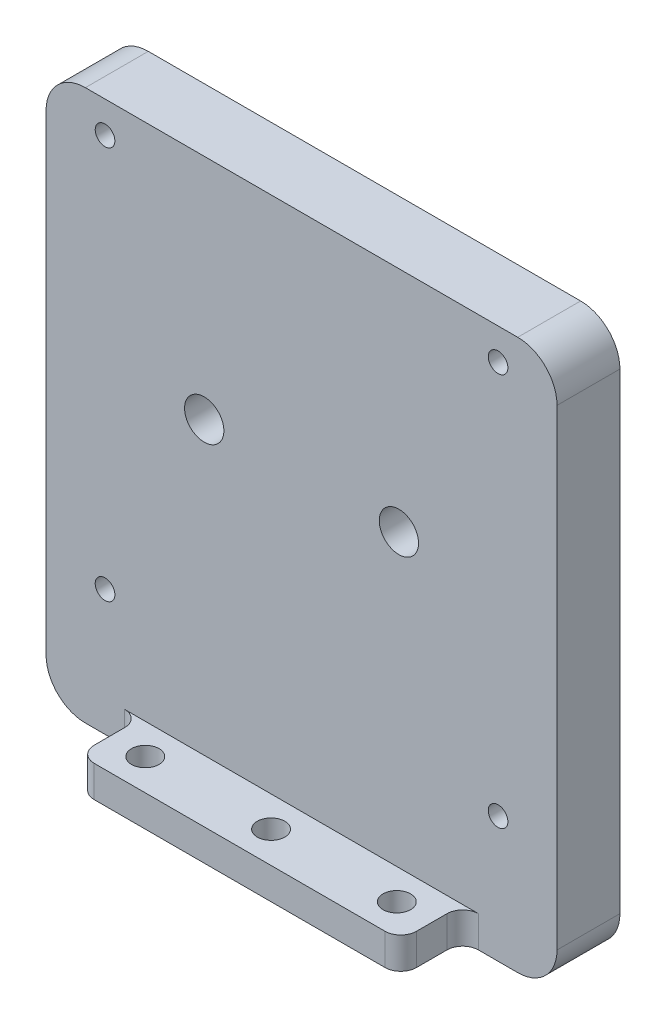
ISO-10303-21;
HEADER;
FILE_DESCRIPTION(('STEP AP214'),'2;1');
FILE_NAME('part.step','',(''),(''),'','','');
FILE_SCHEMA(('AUTOMOTIVE_DESIGN { 1 0 10303 214 1 1 1 1 }'));
ENDSEC;
DATA;
#1=APPLICATION_CONTEXT('core data for automotive mechanical design processes');
#2=APPLICATION_PROTOCOL_DEFINITION('international standard','automotive_design',2000,#1);
#3=PRODUCT_CONTEXT('',#1,'mechanical');
#4=PRODUCT('Part','Part','',(#3));
#5=PRODUCT_RELATED_PRODUCT_CATEGORY('part','',(#4));
#6=PRODUCT_DEFINITION_FORMATION('','',#4);
#7=PRODUCT_DEFINITION_CONTEXT('part definition',#1,'design');
#8=PRODUCT_DEFINITION('design','',#6,#7);
#9=PRODUCT_DEFINITION_SHAPE('','',#8);
#10=(LENGTH_UNIT() NAMED_UNIT(*) SI_UNIT(.MILLI.,.METRE.));
#11=(NAMED_UNIT(*) PLANE_ANGLE_UNIT() SI_UNIT($,.RADIAN.));
#12=(NAMED_UNIT(*) SI_UNIT($,.STERADIAN.) SOLID_ANGLE_UNIT());
#13=UNCERTAINTY_MEASURE_WITH_UNIT(LENGTH_MEASURE(1.E-05),#10,'distance_accuracy_value','');
#14=(GEOMETRIC_REPRESENTATION_CONTEXT(3) GLOBAL_UNCERTAINTY_ASSIGNED_CONTEXT((#13)) GLOBAL_UNIT_ASSIGNED_CONTEXT((#10,
#11,#12)) REPRESENTATION_CONTEXT('',''));
#15=CARTESIAN_POINT('',(0.,0.,0.));
#16=DIRECTION('',(0.,0.,1.));
#17=DIRECTION('',(1.,0.,0.));
#18=AXIS2_PLACEMENT_3D('',#15,#16,#17);
#19=CARTESIAN_POINT('',(0.,0.,0.));
#20=DIRECTION('',(0.,0.,1.));
#21=DIRECTION('',(1.,0.,0.));
#22=AXIS2_PLACEMENT_3D('',#19,#20,#21);
#23=PLANE('',#22);
#24=CARTESIAN_POINT('',(12.3825,6.00000000000001,0.));
#25=DIRECTION('',(0.,0.,-1.));
#26=DIRECTION('',(-1.,0.,0.));
#27=AXIS2_PLACEMENT_3D('',#24,#25,#26);
#28=CIRCLE('',#27,2.49999999999999);
#29=CARTESIAN_POINT('',(9.88250000000001,6.00000000000001,0.));
#30=VERTEX_POINT('',#29);
#31=EDGE_CURVE('E699',#30,#30,#28,.T.);
#32=ORIENTED_EDGE('',*,*,#31,.F.);
#33=EDGE_LOOP('',(#32));
#34=FACE_BOUND('',#33,.T.);
#35=CARTESIAN_POINT('',(-12.3825,6.00000000000001,0.));
#36=DIRECTION('',(0.,0.,-1.));
#37=DIRECTION('',(-1.,0.,0.));
#38=AXIS2_PLACEMENT_3D('',#35,#36,#37);
#39=CIRCLE('',#38,2.49999999999999);
#40=CARTESIAN_POINT('',(-14.8825,6.00000000000001,0.));
#41=VERTEX_POINT('',#40);
#42=EDGE_CURVE('E703',#41,#41,#39,.T.);
#43=ORIENTED_EDGE('',*,*,#42,.F.);
#44=EDGE_LOOP('',(#43));
#45=FACE_BOUND('',#44,.T.);
#46=CARTESIAN_POINT('',(25.,-19.,0.));
#47=DIRECTION('',(0.,0.,-1.));
#48=DIRECTION('',(-1.,0.,0.));
#49=AXIS2_PLACEMENT_3D('',#46,#47,#48);
#50=CIRCLE('',#49,1.25);
#51=CARTESIAN_POINT('',(23.75,-19.,0.));
#52=VERTEX_POINT('',#51);
#53=EDGE_CURVE('E333',#52,#52,#50,.T.);
#54=ORIENTED_EDGE('',*,*,#53,.F.);
#55=EDGE_LOOP('',(#54));
#56=FACE_BOUND('',#55,.T.);
#57=CARTESIAN_POINT('',(25.,31.,0.));
#58=DIRECTION('',(0.,0.,-1.));
#59=DIRECTION('',(-1.,0.,0.));
#60=AXIS2_PLACEMENT_3D('',#57,#58,#59);
#61=CIRCLE('',#60,1.25);
#62=CARTESIAN_POINT('',(23.75,31.,0.));
#63=VERTEX_POINT('',#62);
#64=EDGE_CURVE('E319',#63,#63,#61,.T.);
#65=ORIENTED_EDGE('',*,*,#64,.F.);
#66=EDGE_LOOP('',(#65));
#67=FACE_BOUND('',#66,.T.);
#68=CARTESIAN_POINT('',(-25.,31.,0.));
#69=DIRECTION('',(0.,0.,-1.));
#70=DIRECTION('',(-1.,0.,0.));
#71=AXIS2_PLACEMENT_3D('',#68,#69,#70);
#72=CIRCLE('',#71,1.25);
#73=CARTESIAN_POINT('',(-26.25,31.,0.));
#74=VERTEX_POINT('',#73);
#75=EDGE_CURVE('E315',#74,#74,#72,.T.);
#76=ORIENTED_EDGE('',*,*,#75,.F.);
#77=EDGE_LOOP('',(#76));
#78=FACE_BOUND('',#77,.T.);
#79=DIRECTION('',(0.,1.,0.));
#80=VECTOR('',#79,1.);
#81=CARTESIAN_POINT('',(32.5,35.,0.));
#82=LINE('',#81,#80);
#83=CARTESIAN_POINT('',(32.5,-30.,0.));
#84=VERTEX_POINT('',#83);
#85=CARTESIAN_POINT('',(32.5,30.,0.));
#86=VERTEX_POINT('',#85);
#87=EDGE_CURVE('E178',#84,#86,#82,.T.);
#88=ORIENTED_EDGE('',*,*,#87,.F.);
#89=CARTESIAN_POINT('',(27.5,-30.,0.));
#90=DIRECTION('',(0.,0.,1.));
#91=DIRECTION('',(1.,0.,0.));
#92=AXIS2_PLACEMENT_3D('',#89,#90,#91);
#93=CIRCLE('',#92,5.);
#94=CARTESIAN_POINT('',(27.5,-35.,0.));
#95=VERTEX_POINT('',#94);
#96=EDGE_CURVE('E159',#84,#95,#93,.F.);
#97=ORIENTED_EDGE('',*,*,#96,.T.);
#98=DIRECTION('',(1.,0.,0.));
#99=VECTOR('',#98,1.);
#100=CARTESIAN_POINT('',(-32.5,-35.,0.));
#101=LINE('',#100,#99);
#102=CARTESIAN_POINT('',(-27.5,-35.,0.));
#103=VERTEX_POINT('',#102);
#104=EDGE_CURVE('E207',#103,#95,#101,.T.);
#105=ORIENTED_EDGE('',*,*,#104,.F.);
#106=CARTESIAN_POINT('',(-27.5,-30.,0.));
#107=DIRECTION('',(0.,0.,1.));
#108=DIRECTION('',(1.,0.,0.));
#109=AXIS2_PLACEMENT_3D('',#106,#107,#108);
#110=CIRCLE('',#109,5.);
#111=CARTESIAN_POINT('',(-32.5,-30.,0.));
#112=VERTEX_POINT('',#111);
#113=EDGE_CURVE('E172',#103,#112,#110,.F.);
#114=ORIENTED_EDGE('',*,*,#113,.T.);
#115=DIRECTION('',(0.,-1.,0.));
#116=VECTOR('',#115,1.);
#117=CARTESIAN_POINT('',(-32.5,35.,0.));
#118=LINE('',#117,#116);
#119=CARTESIAN_POINT('',(-32.5,30.,0.));
#120=VERTEX_POINT('',#119);
#121=EDGE_CURVE('E196',#120,#112,#118,.T.);
#122=ORIENTED_EDGE('',*,*,#121,.F.);
#123=CARTESIAN_POINT('',(-27.5,30.,0.));
#124=DIRECTION('',(0.,0.,1.));
#125=DIRECTION('',(1.,0.,0.));
#126=AXIS2_PLACEMENT_3D('',#123,#124,#125);
#127=CIRCLE('',#126,5.);
#128=CARTESIAN_POINT('',(-27.5,35.,0.));
#129=VERTEX_POINT('',#128);
#130=EDGE_CURVE('E183',#120,#129,#127,.F.);
#131=ORIENTED_EDGE('',*,*,#130,.T.);
#132=DIRECTION('',(-1.,0.,0.));
#133=VECTOR('',#132,1.);
#134=CARTESIAN_POINT('',(-32.5,35.,0.));
#135=LINE('',#134,#133);
#136=CARTESIAN_POINT('',(27.5,35.,0.));
#137=VERTEX_POINT('',#136);
#138=EDGE_CURVE('E190',#137,#129,#135,.T.);
#139=ORIENTED_EDGE('',*,*,#138,.F.);
#140=CARTESIAN_POINT('',(27.5,30.,0.));
#141=DIRECTION('',(0.,0.,1.));
#142=DIRECTION('',(1.,0.,0.));
#143=AXIS2_PLACEMENT_3D('',#140,#141,#142);
#144=CIRCLE('',#143,5.);
#145=EDGE_CURVE('E188',#137,#86,#144,.F.);
#146=ORIENTED_EDGE('',*,*,#145,.T.);
#147=EDGE_LOOP('',(#88,#97,#105,#114,#122,#131,#139,#146));
#148=FACE_BOUND('',#147,.T.);
#149=CARTESIAN_POINT('',(-25.,-19.,0.));
#150=DIRECTION('',(0.,0.,-1.));
#151=DIRECTION('',(-1.,0.,0.));
#152=AXIS2_PLACEMENT_3D('',#149,#150,#151);
#153=CIRCLE('',#152,1.25);
#154=CARTESIAN_POINT('',(-26.25,-19.,0.));
#155=VERTEX_POINT('',#154);
#156=EDGE_CURVE('E314',#155,#155,#153,.T.);
#157=ORIENTED_EDGE('',*,*,#156,.F.);
#158=EDGE_LOOP('',(#157));
#159=FACE_BOUND('',#158,.T.);
#160=ADVANCED_FACE('F43',(#34,#45,#56,#67,#78,#148,#159),#23,.F.);
#161=CARTESIAN_POINT('',(32.5,35.,8.));
#162=DIRECTION('',(-1.,0.,0.));
#163=DIRECTION('',(0.,-1.,0.));
#164=AXIS2_PLACEMENT_3D('',#161,#162,#163);
#165=PLANE('',#164);
#166=DIRECTION('',(0.,1.,0.));
#167=VECTOR('',#166,1.);
#168=CARTESIAN_POINT('',(32.5,35.,8.));
#169=LINE('',#168,#167);
#170=CARTESIAN_POINT('',(32.5,-30.,8.));
#171=VERTEX_POINT('',#170);
#172=CARTESIAN_POINT('',(32.5,30.,8.));
#173=VERTEX_POINT('',#172);
#174=EDGE_CURVE('E181',#171,#173,#169,.T.);
#175=ORIENTED_EDGE('',*,*,#174,.F.);
#176=DIRECTION('',(0.,0.,-1.));
#177=VECTOR('',#176,1.);
#178=CARTESIAN_POINT('',(32.5,-30.,8.));
#179=LINE('',#178,#177);
#180=EDGE_CURVE('E163',#171,#84,#179,.T.);
#181=ORIENTED_EDGE('',*,*,#180,.T.);
#182=ORIENTED_EDGE('',*,*,#87,.T.);
#183=DIRECTION('',(0.,0.,-1.));
#184=VECTOR('',#183,1.);
#185=CARTESIAN_POINT('',(32.5,30.,8.));
#186=LINE('',#185,#184);
#187=EDGE_CURVE('E184',#86,#173,#186,.F.);
#188=ORIENTED_EDGE('',*,*,#187,.T.);
#189=EDGE_LOOP('',(#175,#181,#182,#188));
#190=FACE_BOUND('',#189,.T.);
#191=ADVANCED_FACE('F177',(#190),#165,.F.);
#192=CARTESIAN_POINT('',(-32.5,35.,8.));
#193=DIRECTION('',(0.,-1.,0.));
#194=DIRECTION('',(0.,0.,-1.));
#195=AXIS2_PLACEMENT_3D('',#192,#193,#194);
#196=PLANE('',#195);
#197=DIRECTION('',(-1.,0.,0.));
#198=VECTOR('',#197,1.);
#199=CARTESIAN_POINT('',(-32.5,35.,8.));
#200=LINE('',#199,#198);
#201=CARTESIAN_POINT('',(27.5,35.,8.));
#202=VERTEX_POINT('',#201);
#203=CARTESIAN_POINT('',(-27.5,35.,8.));
#204=VERTEX_POINT('',#203);
#205=EDGE_CURVE('E378',#202,#204,#200,.T.);
#206=ORIENTED_EDGE('',*,*,#205,.F.);
#207=DIRECTION('',(0.,0.,-1.));
#208=VECTOR('',#207,1.);
#209=CARTESIAN_POINT('',(27.5,35.,8.));
#210=LINE('',#209,#208);
#211=EDGE_CURVE('E245',#202,#137,#210,.T.);
#212=ORIENTED_EDGE('',*,*,#211,.T.);
#213=ORIENTED_EDGE('',*,*,#138,.T.);
#214=DIRECTION('',(0.,0.,-1.));
#215=VECTOR('',#214,1.);
#216=CARTESIAN_POINT('',(-27.5,35.,8.));
#217=LINE('',#216,#215);
#218=EDGE_CURVE('E242',#129,#204,#217,.F.);
#219=ORIENTED_EDGE('',*,*,#218,.T.);
#220=EDGE_LOOP('',(#206,#212,#213,#219));
#221=FACE_BOUND('',#220,.T.);
#222=ADVANCED_FACE('F430',(#221),#196,.F.);
#223=CARTESIAN_POINT('',(-32.5,35.,8.));
#224=DIRECTION('',(1.,0.,0.));
#225=DIRECTION('',(0.,1.,0.));
#226=AXIS2_PLACEMENT_3D('',#223,#224,#225);
#227=PLANE('',#226);
#228=ORIENTED_EDGE('',*,*,#121,.T.);
#229=DIRECTION('',(0.,0.,-1.));
#230=VECTOR('',#229,1.);
#231=CARTESIAN_POINT('',(-32.5,-30.,8.));
#232=LINE('',#231,#230);
#233=CARTESIAN_POINT('',(-32.5,-30.,8.));
#234=VERTEX_POINT('',#233);
#235=EDGE_CURVE('E239',#112,#234,#232,.F.);
#236=ORIENTED_EDGE('',*,*,#235,.T.);
#237=DIRECTION('',(0.,-1.,0.));
#238=VECTOR('',#237,1.);
#239=CARTESIAN_POINT('',(-32.5,35.,8.));
#240=LINE('',#239,#238);
#241=CARTESIAN_POINT('',(-32.5,30.,8.));
#242=VERTEX_POINT('',#241);
#243=EDGE_CURVE('E381',#242,#234,#240,.T.);
#244=ORIENTED_EDGE('',*,*,#243,.F.);
#245=DIRECTION('',(0.,0.,-1.));
#246=VECTOR('',#245,1.);
#247=CARTESIAN_POINT('',(-32.5,30.,8.));
#248=LINE('',#247,#246);
#249=EDGE_CURVE('E235',#242,#120,#248,.T.);
#250=ORIENTED_EDGE('',*,*,#249,.T.);
#251=EDGE_LOOP('',(#228,#236,#244,#250));
#252=FACE_BOUND('',#251,.T.);
#253=ADVANCED_FACE('F438',(#252),#227,.F.);
#254=CARTESIAN_POINT('',(-32.5,-35.,8.));
#255=DIRECTION('',(0.,1.,0.));
#256=DIRECTION('',(0.,0.,1.));
#257=AXIS2_PLACEMENT_3D('',#254,#255,#256);
#258=PLANE('',#257);
#259=CARTESIAN_POINT('',(16.,-35.,11.8798952798945));
#260=DIRECTION('',(0.,-1.,0.));
#261=DIRECTION('',(0.,0.,-1.));
#262=AXIS2_PLACEMENT_3D('',#259,#260,#261);
#263=CIRCLE('',#262,1.75);
#264=CARTESIAN_POINT('',(16.,-35.,10.1298952798945));
#265=VERTEX_POINT('',#264);
#266=EDGE_CURVE('E344',#265,#265,#263,.T.);
#267=ORIENTED_EDGE('',*,*,#266,.F.);
#268=EDGE_LOOP('',(#267));
#269=FACE_BOUND('',#268,.T.);
#270=CARTESIAN_POINT('',(-16.,-35.,11.8798952798945));
#271=DIRECTION('',(0.,-1.,0.));
#272=DIRECTION('',(0.,0.,-1.));
#273=AXIS2_PLACEMENT_3D('',#270,#271,#272);
#274=CIRCLE('',#273,1.75);
#275=CARTESIAN_POINT('',(-16.,-35.,10.1298952798945));
#276=VERTEX_POINT('',#275);
#277=EDGE_CURVE('E345',#276,#276,#274,.T.);
#278=ORIENTED_EDGE('',*,*,#277,.F.);
#279=EDGE_LOOP('',(#278));
#280=FACE_BOUND('',#279,.T.);
#281=CARTESIAN_POINT('',(0.,-35.,11.8798952798945));
#282=DIRECTION('',(0.,-1.,0.));
#283=DIRECTION('',(0.,0.,-1.));
#284=AXIS2_PLACEMENT_3D('',#281,#282,#283);
#285=CIRCLE('',#284,1.75);
#286=CARTESIAN_POINT('',(0.,-35.,10.1298952798945));
#287=VERTEX_POINT('',#286);
#288=EDGE_CURVE('E302',#287,#287,#285,.T.);
#289=ORIENTED_EDGE('',*,*,#288,.F.);
#290=EDGE_LOOP('',(#289));
#291=FACE_BOUND('',#290,.T.);
#292=DIRECTION('',(0.,0.,-1.));
#293=VECTOR('',#292,1.);
#294=CARTESIAN_POINT('',(20.5,-35.,15.8798952798945));
#295=LINE('',#294,#293);
#296=CARTESIAN_POINT('',(20.5,-35.,13.8798952798945));
#297=VERTEX_POINT('',#296);
#298=CARTESIAN_POINT('',(20.5,-35.,10.));
#299=VERTEX_POINT('',#298);
#300=EDGE_CURVE('E198',#297,#299,#295,.T.);
#301=ORIENTED_EDGE('',*,*,#300,.F.);
#302=CARTESIAN_POINT('',(18.5,-35.,13.8798952798945));
#303=DIRECTION('',(0.,1.,0.));
#304=DIRECTION('',(0.,0.,1.));
#305=AXIS2_PLACEMENT_3D('',#302,#303,#304);
#306=CIRCLE('',#305,2.);
#307=CARTESIAN_POINT('',(18.5,-35.,15.8798952798945));
#308=VERTEX_POINT('',#307);
#309=EDGE_CURVE('E279',#297,#308,#306,.F.);
#310=ORIENTED_EDGE('',*,*,#309,.T.);
#311=DIRECTION('',(1.,0.,0.));
#312=VECTOR('',#311,1.);
#313=CARTESIAN_POINT('',(-20.5,-35.,15.8798952798945));
#314=LINE('',#313,#312);
#315=CARTESIAN_POINT('',(-18.5,-35.,15.8798952798945));
#316=VERTEX_POINT('',#315);
#317=EDGE_CURVE('E355',#316,#308,#314,.T.);
#318=ORIENTED_EDGE('',*,*,#317,.F.);
#319=CARTESIAN_POINT('',(-18.5,-35.,13.8798952798945));
#320=DIRECTION('',(0.,1.,0.));
#321=DIRECTION('',(0.,0.,1.));
#322=AXIS2_PLACEMENT_3D('',#319,#320,#321);
#323=CIRCLE('',#322,2.);
#324=CARTESIAN_POINT('',(-20.5,-35.,13.8798952798945));
#325=VERTEX_POINT('',#324);
#326=EDGE_CURVE('E68',#316,#325,#323,.F.);
#327=ORIENTED_EDGE('',*,*,#326,.T.);
#328=DIRECTION('',(0.,0.,-1.));
#329=VECTOR('',#328,1.);
#330=CARTESIAN_POINT('',(-20.5,-35.,15.8798952798945));
#331=LINE('',#330,#329);
#332=CARTESIAN_POINT('',(-20.5,-35.,10.));
#333=VERTEX_POINT('',#332);
#334=EDGE_CURVE('E191',#325,#333,#331,.T.);
#335=ORIENTED_EDGE('',*,*,#334,.T.);
#336=CARTESIAN_POINT('',(-22.5,-35.,10.));
#337=DIRECTION('',(0.,1.,0.));
#338=DIRECTION('',(0.,0.,1.));
#339=AXIS2_PLACEMENT_3D('',#336,#337,#338);
#340=CIRCLE('',#339,2.);
#341=CARTESIAN_POINT('',(-22.5,-35.,8.));
#342=VERTEX_POINT('',#341);
#343=EDGE_CURVE('E53',#333,#342,#340,.T.);
#344=ORIENTED_EDGE('',*,*,#343,.T.);
#345=DIRECTION('',(1.,0.,0.));
#346=VECTOR('',#345,1.);
#347=CARTESIAN_POINT('',(-32.5,-35.,8.));
#348=LINE('',#347,#346);
#349=CARTESIAN_POINT('',(-27.5,-35.,8.));
#350=VERTEX_POINT('',#349);
#351=EDGE_CURVE('E201',#350,#342,#348,.T.);
#352=ORIENTED_EDGE('',*,*,#351,.F.);
#353=DIRECTION('',(0.,0.,-1.));
#354=VECTOR('',#353,1.);
#355=CARTESIAN_POINT('',(-27.5,-35.,8.));
#356=LINE('',#355,#354);
#357=EDGE_CURVE('E171',#350,#103,#356,.T.);
#358=ORIENTED_EDGE('',*,*,#357,.T.);
#359=ORIENTED_EDGE('',*,*,#104,.T.);
#360=DIRECTION('',(0.,0.,-1.));
#361=VECTOR('',#360,1.);
#362=CARTESIAN_POINT('',(27.5,-35.,8.));
#363=LINE('',#362,#361);
#364=CARTESIAN_POINT('',(27.5,-35.,8.));
#365=VERTEX_POINT('',#364);
#366=EDGE_CURVE('E165',#95,#365,#363,.F.);
#367=ORIENTED_EDGE('',*,*,#366,.T.);
#368=CARTESIAN_POINT('',(22.5,-35.,8.));
#369=VERTEX_POINT('',#368);
#370=EDGE_CURVE('E384',#369,#365,#348,.T.);
#371=ORIENTED_EDGE('',*,*,#370,.F.);
#372=CARTESIAN_POINT('',(22.5,-35.,10.));
#373=DIRECTION('',(0.,1.,0.));
#374=DIRECTION('',(0.,0.,1.));
#375=AXIS2_PLACEMENT_3D('',#372,#373,#374);
#376=CIRCLE('',#375,2.);
#377=EDGE_CURVE('E292',#369,#299,#376,.T.);
#378=ORIENTED_EDGE('',*,*,#377,.T.);
#379=EDGE_LOOP('',(#301,#310,#318,#327,#335,#344,#352,#358,#359,#367,#371,#378));
#380=FACE_BOUND('',#379,.T.);
#381=ADVANCED_FACE('F423',(#269,#280,#291,#380),#258,.F.);
#382=CARTESIAN_POINT('',(0.,0.,8.));
#383=DIRECTION('',(0.,0.,1.));
#384=DIRECTION('',(1.,0.,0.));
#385=AXIS2_PLACEMENT_3D('',#382,#383,#384);
#386=PLANE('',#385);
#387=CARTESIAN_POINT('',(12.3825,6.00000000000001,8.));
#388=DIRECTION('',(0.,0.,1.));
#389=DIRECTION('',(1.,0.,0.));
#390=AXIS2_PLACEMENT_3D('',#387,#388,#389);
#391=CIRCLE('',#390,2.49999999999999);
#392=CARTESIAN_POINT('',(14.8825,6.00000000000001,8.));
#393=VERTEX_POINT('',#392);
#394=EDGE_CURVE('E47',#393,#393,#391,.T.);
#395=ORIENTED_EDGE('',*,*,#394,.F.);
#396=EDGE_LOOP('',(#395));
#397=FACE_BOUND('',#396,.T.);
#398=CARTESIAN_POINT('',(-12.3825,6.00000000000001,8.));
#399=DIRECTION('',(0.,0.,1.));
#400=DIRECTION('',(1.,0.,0.));
#401=AXIS2_PLACEMENT_3D('',#398,#399,#400);
#402=CIRCLE('',#401,2.49999999999999);
#403=CARTESIAN_POINT('',(-9.88250000000001,6.00000000000001,8.));
#404=VERTEX_POINT('',#403);
#405=EDGE_CURVE('E708',#404,#404,#402,.T.);
#406=ORIENTED_EDGE('',*,*,#405,.F.);
#407=EDGE_LOOP('',(#406));
#408=FACE_BOUND('',#407,.T.);
#409=CARTESIAN_POINT('',(25.,-19.,8.));
#410=DIRECTION('',(0.,0.,1.));
#411=DIRECTION('',(1.,0.,0.));
#412=AXIS2_PLACEMENT_3D('',#409,#410,#411);
#413=CIRCLE('',#412,1.25);
#414=CARTESIAN_POINT('',(26.25,-19.,8.));
#415=VERTEX_POINT('',#414);
#416=EDGE_CURVE('E327',#415,#415,#413,.T.);
#417=ORIENTED_EDGE('',*,*,#416,.F.);
#418=EDGE_LOOP('',(#417));
#419=FACE_BOUND('',#418,.T.);
#420=CARTESIAN_POINT('',(25.,31.,8.));
#421=DIRECTION('',(0.,0.,1.));
#422=DIRECTION('',(1.,0.,0.));
#423=AXIS2_PLACEMENT_3D('',#420,#421,#422);
#424=CIRCLE('',#423,1.25);
#425=CARTESIAN_POINT('',(26.25,31.,8.));
#426=VERTEX_POINT('',#425);
#427=EDGE_CURVE('E316',#426,#426,#424,.T.);
#428=ORIENTED_EDGE('',*,*,#427,.F.);
#429=EDGE_LOOP('',(#428));
#430=FACE_BOUND('',#429,.T.);
#431=CARTESIAN_POINT('',(-25.,31.,8.));
#432=DIRECTION('',(0.,0.,1.));
#433=DIRECTION('',(1.,0.,0.));
#434=AXIS2_PLACEMENT_3D('',#431,#432,#433);
#435=CIRCLE('',#434,1.25);
#436=CARTESIAN_POINT('',(-23.75,31.,8.));
#437=VERTEX_POINT('',#436);
#438=EDGE_CURVE('E311',#437,#437,#435,.T.);
#439=ORIENTED_EDGE('',*,*,#438,.F.);
#440=EDGE_LOOP('',(#439));
#441=FACE_BOUND('',#440,.T.);
#442=CARTESIAN_POINT('',(-25.,-19.,8.));
#443=DIRECTION('',(0.,0.,1.));
#444=DIRECTION('',(1.,0.,0.));
#445=AXIS2_PLACEMENT_3D('',#442,#443,#444);
#446=CIRCLE('',#445,1.25);
#447=CARTESIAN_POINT('',(-23.75,-19.,8.));
#448=VERTEX_POINT('',#447);
#449=EDGE_CURVE('E340',#448,#448,#446,.T.);
#450=ORIENTED_EDGE('',*,*,#449,.F.);
#451=EDGE_LOOP('',(#450));
#452=FACE_BOUND('',#451,.T.);
#453=DIRECTION('',(-1.,0.,0.));
#454=VECTOR('',#453,1.);
#455=CARTESIAN_POINT('',(-20.5,-31.,8.));
#456=LINE('',#455,#454);
#457=CARTESIAN_POINT('',(22.5,-31.,8.));
#458=VERTEX_POINT('',#457);
#459=CARTESIAN_POINT('',(-22.5,-31.,8.));
#460=VERTEX_POINT('',#459);
#461=EDGE_CURVE('E310',#458,#460,#456,.T.);
#462=ORIENTED_EDGE('',*,*,#461,.F.);
#463=DIRECTION('',(0.,1.,0.));
#464=VECTOR('',#463,1.);
#465=CARTESIAN_POINT('',(22.4999999999995,3.12250225675819E-13,8.));
#466=LINE('',#465,#464);
#467=EDGE_CURVE('E260',#458,#369,#466,.F.);
#468=ORIENTED_EDGE('',*,*,#467,.T.);
#469=ORIENTED_EDGE('',*,*,#370,.T.);
#470=CARTESIAN_POINT('',(27.5,-30.,8.));
#471=DIRECTION('',(0.,0.,1.));
#472=DIRECTION('',(1.,0.,0.));
#473=AXIS2_PLACEMENT_3D('',#470,#471,#472);
#474=CIRCLE('',#473,5.);
#475=EDGE_CURVE('E232',#365,#171,#474,.T.);
#476=ORIENTED_EDGE('',*,*,#475,.T.);
#477=ORIENTED_EDGE('',*,*,#174,.T.);
#478=CARTESIAN_POINT('',(27.5,30.,8.));
#479=DIRECTION('',(0.,0.,1.));
#480=DIRECTION('',(1.,0.,0.));
#481=AXIS2_PLACEMENT_3D('',#478,#479,#480);
#482=CIRCLE('',#481,5.);
#483=EDGE_CURVE('E226',#173,#202,#482,.T.);
#484=ORIENTED_EDGE('',*,*,#483,.T.);
#485=ORIENTED_EDGE('',*,*,#205,.T.);
#486=CARTESIAN_POINT('',(-27.5,30.,8.));
#487=DIRECTION('',(0.,0.,1.));
#488=DIRECTION('',(1.,0.,0.));
#489=AXIS2_PLACEMENT_3D('',#486,#487,#488);
#490=CIRCLE('',#489,5.);
#491=EDGE_CURVE('E223',#204,#242,#490,.T.);
#492=ORIENTED_EDGE('',*,*,#491,.T.);
#493=ORIENTED_EDGE('',*,*,#243,.T.);
#494=CARTESIAN_POINT('',(-27.5,-30.,8.));
#495=DIRECTION('',(0.,0.,1.));
#496=DIRECTION('',(1.,0.,0.));
#497=AXIS2_PLACEMENT_3D('',#494,#495,#496);
#498=CIRCLE('',#497,5.);
#499=EDGE_CURVE('E229',#234,#350,#498,.T.);
#500=ORIENTED_EDGE('',*,*,#499,.T.);
#501=ORIENTED_EDGE('',*,*,#351,.T.);
#502=DIRECTION('',(0.,-1.,0.));
#503=VECTOR('',#502,1.);
#504=CARTESIAN_POINT('',(-22.5,0.,8.));
#505=LINE('',#504,#503);
#506=EDGE_CURVE('E256',#342,#460,#505,.F.);
#507=ORIENTED_EDGE('',*,*,#506,.T.);
#508=EDGE_LOOP('',(#462,#468,#469,#476,#477,#484,#485,#492,#493,#500,#501,#507));
#509=FACE_BOUND('',#508,.T.);
#510=ADVANCED_FACE('F393',(#397,#408,#419,#430,#441,#452,#509),#386,.T.);
#511=CARTESIAN_POINT('',(27.5,-30.,8.));
#512=DIRECTION('',(0.,0.,-1.));
#513=DIRECTION('',(-1.,0.,0.));
#514=AXIS2_PLACEMENT_3D('',#511,#512,#513);
#515=CYLINDRICAL_SURFACE('',#514,5.);
#516=ORIENTED_EDGE('',*,*,#475,.F.);
#517=ORIENTED_EDGE('',*,*,#366,.F.);
#518=ORIENTED_EDGE('',*,*,#96,.F.);
#519=ORIENTED_EDGE('',*,*,#180,.F.);
#520=EDGE_LOOP('',(#516,#517,#518,#519));
#521=FACE_BOUND('',#520,.T.);
#522=ADVANCED_FACE('F162',(#521),#515,.T.);
#523=CARTESIAN_POINT('',(-27.5,-30.,8.));
#524=DIRECTION('',(0.,0.,-1.));
#525=DIRECTION('',(-1.,0.,0.));
#526=AXIS2_PLACEMENT_3D('',#523,#524,#525);
#527=CYLINDRICAL_SURFACE('',#526,5.);
#528=ORIENTED_EDGE('',*,*,#499,.F.);
#529=ORIENTED_EDGE('',*,*,#235,.F.);
#530=ORIENTED_EDGE('',*,*,#113,.F.);
#531=ORIENTED_EDGE('',*,*,#357,.F.);
#532=EDGE_LOOP('',(#528,#529,#530,#531));
#533=FACE_BOUND('',#532,.T.);
#534=ADVANCED_FACE('F441',(#533),#527,.T.);
#535=CARTESIAN_POINT('',(27.5,30.,8.));
#536=DIRECTION('',(0.,0.,-1.));
#537=DIRECTION('',(-1.,0.,0.));
#538=AXIS2_PLACEMENT_3D('',#535,#536,#537);
#539=CYLINDRICAL_SURFACE('',#538,5.);
#540=ORIENTED_EDGE('',*,*,#483,.F.);
#541=ORIENTED_EDGE('',*,*,#187,.F.);
#542=ORIENTED_EDGE('',*,*,#145,.F.);
#543=ORIENTED_EDGE('',*,*,#211,.F.);
#544=EDGE_LOOP('',(#540,#541,#542,#543));
#545=FACE_BOUND('',#544,.T.);
#546=ADVANCED_FACE('F428',(#545),#539,.T.);
#547=CARTESIAN_POINT('',(-27.5,30.,8.));
#548=DIRECTION('',(0.,0.,-1.));
#549=DIRECTION('',(-1.,0.,0.));
#550=AXIS2_PLACEMENT_3D('',#547,#548,#549);
#551=CYLINDRICAL_SURFACE('',#550,5.);
#552=ORIENTED_EDGE('',*,*,#491,.F.);
#553=ORIENTED_EDGE('',*,*,#218,.F.);
#554=ORIENTED_EDGE('',*,*,#130,.F.);
#555=ORIENTED_EDGE('',*,*,#249,.F.);
#556=EDGE_LOOP('',(#552,#553,#554,#555));
#557=FACE_BOUND('',#556,.T.);
#558=ADVANCED_FACE('F436',(#557),#551,.T.);
#559=CARTESIAN_POINT('',(-20.5,-35.,15.8798952798945));
#560=DIRECTION('',(1.,0.,0.));
#561=DIRECTION('',(0.,0.,-1.));
#562=AXIS2_PLACEMENT_3D('',#559,#560,#561);
#563=PLANE('',#562);
#564=ORIENTED_EDGE('',*,*,#334,.F.);
#565=DIRECTION('',(0.,-1.,0.));
#566=VECTOR('',#565,1.);
#567=CARTESIAN_POINT('',(-20.5,-35.,13.8798952798945));
#568=LINE('',#567,#566);
#569=CARTESIAN_POINT('',(-20.5,-31.,13.8798952798945));
#570=VERTEX_POINT('',#569);
#571=EDGE_CURVE('E285',#325,#570,#568,.F.);
#572=ORIENTED_EDGE('',*,*,#571,.T.);
#573=DIRECTION('',(0.,0.,-1.));
#574=VECTOR('',#573,1.);
#575=CARTESIAN_POINT('',(-20.5,-31.,15.8798952798945));
#576=LINE('',#575,#574);
#577=CARTESIAN_POINT('',(-20.5,-31.,10.));
#578=VERTEX_POINT('',#577);
#579=EDGE_CURVE('E363',#570,#578,#576,.T.);
#580=ORIENTED_EDGE('',*,*,#579,.T.);
#581=DIRECTION('',(0.,-1.,0.));
#582=VECTOR('',#581,1.);
#583=CARTESIAN_POINT('',(-20.5,-35.,10.));
#584=LINE('',#583,#582);
#585=EDGE_CURVE('E282',#578,#333,#584,.T.);
#586=ORIENTED_EDGE('',*,*,#585,.T.);
#587=EDGE_LOOP('',(#564,#572,#580,#586));
#588=FACE_BOUND('',#587,.T.);
#589=ADVANCED_FACE('F402',(#588),#563,.F.);
#590=CARTESIAN_POINT('',(20.5,-35.,15.8798952798945));
#591=DIRECTION('',(-1.,0.,0.));
#592=DIRECTION('',(0.,-1.,0.));
#593=AXIS2_PLACEMENT_3D('',#590,#591,#592);
#594=PLANE('',#593);
#595=ORIENTED_EDGE('',*,*,#300,.T.);
#596=DIRECTION('',(0.,1.,0.));
#597=VECTOR('',#596,1.);
#598=CARTESIAN_POINT('',(20.5,-35.,10.));
#599=LINE('',#598,#597);
#600=CARTESIAN_POINT('',(20.5,-31.,10.));
#601=VERTEX_POINT('',#600);
#602=EDGE_CURVE('E252',#299,#601,#599,.T.);
#603=ORIENTED_EDGE('',*,*,#602,.T.);
#604=DIRECTION('',(0.,0.,-1.));
#605=VECTOR('',#604,1.);
#606=CARTESIAN_POINT('',(20.5,-31.,15.8798952798945));
#607=LINE('',#606,#605);
#608=CARTESIAN_POINT('',(20.5,-31.,13.8798952798945));
#609=VERTEX_POINT('',#608);
#610=EDGE_CURVE('E369',#609,#601,#607,.T.);
#611=ORIENTED_EDGE('',*,*,#610,.F.);
#612=DIRECTION('',(0.,1.,0.));
#613=VECTOR('',#612,1.);
#614=CARTESIAN_POINT('',(20.5,-35.,13.8798952798945));
#615=LINE('',#614,#613);
#616=EDGE_CURVE('E249',#609,#297,#615,.F.);
#617=ORIENTED_EDGE('',*,*,#616,.T.);
#618=EDGE_LOOP('',(#595,#603,#611,#617));
#619=FACE_BOUND('',#618,.T.);
#620=ADVANCED_FACE('F416',(#619),#594,.F.);
#621=CARTESIAN_POINT('',(-20.5,-31.,15.8798952798945));
#622=DIRECTION('',(0.,-1.,0.));
#623=DIRECTION('',(1.,0.,0.));
#624=AXIS2_PLACEMENT_3D('',#621,#622,#623);
#625=PLANE('',#624);
#626=CARTESIAN_POINT('',(16.,-31.,11.8798952798945));
#627=DIRECTION('',(0.,-1.,0.));
#628=DIRECTION('',(1.,0.,0.));
#629=AXIS2_PLACEMENT_3D('',#626,#627,#628);
#630=CIRCLE('',#629,1.75);
#631=CARTESIAN_POINT('',(17.75,-31.,11.8798952798945));
#632=VERTEX_POINT('',#631);
#633=EDGE_CURVE('E306',#632,#632,#630,.T.);
#634=ORIENTED_EDGE('',*,*,#633,.T.);
#635=EDGE_LOOP('',(#634));
#636=FACE_BOUND('',#635,.T.);
#637=CARTESIAN_POINT('',(-16.,-31.,11.8798952798945));
#638=DIRECTION('',(0.,-1.,0.));
#639=DIRECTION('',(1.,0.,0.));
#640=AXIS2_PLACEMENT_3D('',#637,#638,#639);
#641=CIRCLE('',#640,1.75);
#642=CARTESIAN_POINT('',(-14.25,-31.,11.8798952798945));
#643=VERTEX_POINT('',#642);
#644=EDGE_CURVE('E301',#643,#643,#641,.T.);
#645=ORIENTED_EDGE('',*,*,#644,.T.);
#646=EDGE_LOOP('',(#645));
#647=FACE_BOUND('',#646,.T.);
#648=CARTESIAN_POINT('',(0.,-31.,11.8798952798945));
#649=DIRECTION('',(0.,-1.,0.));
#650=DIRECTION('',(1.,0.,0.));
#651=AXIS2_PLACEMENT_3D('',#648,#649,#650);
#652=CIRCLE('',#651,1.75);
#653=CARTESIAN_POINT('',(1.75,-31.,11.8798952798945));
#654=VERTEX_POINT('',#653);
#655=EDGE_CURVE('E297',#654,#654,#652,.T.);
#656=ORIENTED_EDGE('',*,*,#655,.T.);
#657=EDGE_LOOP('',(#656));
#658=FACE_BOUND('',#657,.T.);
#659=DIRECTION('',(-1.,0.,0.));
#660=VECTOR('',#659,1.);
#661=CARTESIAN_POINT('',(-20.5,-31.,15.8798952798945));
#662=LINE('',#661,#660);
#663=CARTESIAN_POINT('',(18.5,-31.,15.8798952798945));
#664=VERTEX_POINT('',#663);
#665=CARTESIAN_POINT('',(-18.5,-31.,15.8798952798945));
#666=VERTEX_POINT('',#665);
#667=EDGE_CURVE('E359',#664,#666,#662,.T.);
#668=ORIENTED_EDGE('',*,*,#667,.F.);
#669=CARTESIAN_POINT('',(18.5,-31.,13.8798952798945));
#670=DIRECTION('',(0.,-1.,0.));
#671=DIRECTION('',(1.,0.,0.));
#672=AXIS2_PLACEMENT_3D('',#669,#670,#671);
#673=CIRCLE('',#672,2.);
#674=EDGE_CURVE('E274',#664,#609,#673,.F.);
#675=ORIENTED_EDGE('',*,*,#674,.T.);
#676=ORIENTED_EDGE('',*,*,#610,.T.);
#677=CARTESIAN_POINT('',(22.5,-31.,10.));
#678=DIRECTION('',(0.,-1.,0.));
#679=DIRECTION('',(1.,0.,0.));
#680=AXIS2_PLACEMENT_3D('',#677,#678,#679);
#681=CIRCLE('',#680,2.);
#682=EDGE_CURVE('E288',#601,#458,#681,.T.);
#683=ORIENTED_EDGE('',*,*,#682,.T.);
#684=ORIENTED_EDGE('',*,*,#461,.T.);
#685=CARTESIAN_POINT('',(-22.5,-31.,10.));
#686=DIRECTION('',(0.,-1.,0.));
#687=DIRECTION('',(1.,0.,0.));
#688=AXIS2_PLACEMENT_3D('',#685,#686,#687);
#689=CIRCLE('',#688,2.);
#690=EDGE_CURVE('E11',#460,#578,#689,.T.);
#691=ORIENTED_EDGE('',*,*,#690,.T.);
#692=ORIENTED_EDGE('',*,*,#579,.F.);
#693=CARTESIAN_POINT('',(-18.5,-31.,13.8798952798945));
#694=DIRECTION('',(0.,-1.,0.));
#695=DIRECTION('',(1.,0.,0.));
#696=AXIS2_PLACEMENT_3D('',#693,#694,#695);
#697=CIRCLE('',#696,2.);
#698=EDGE_CURVE('E271',#570,#666,#697,.F.);
#699=ORIENTED_EDGE('',*,*,#698,.T.);
#700=EDGE_LOOP('',(#668,#675,#676,#683,#684,#691,#692,#699));
#701=FACE_BOUND('',#700,.T.);
#702=ADVANCED_FACE('F399',(#636,#647,#658,#701),#625,.F.);
#703=CARTESIAN_POINT('',(0.,0.,15.8798952798945));
#704=DIRECTION('',(0.,0.,-1.));
#705=DIRECTION('',(-1.,0.,0.));
#706=AXIS2_PLACEMENT_3D('',#703,#704,#705);
#707=PLANE('',#706);
#708=ORIENTED_EDGE('',*,*,#317,.T.);
#709=DIRECTION('',(0.,1.,0.));
#710=VECTOR('',#709,1.);
#711=CARTESIAN_POINT('',(18.4999999999995,2.56739074444561E-13,15.8798952798945));
#712=LINE('',#711,#710);
#713=EDGE_CURVE('E267',#308,#664,#712,.T.);
#714=ORIENTED_EDGE('',*,*,#713,.T.);
#715=ORIENTED_EDGE('',*,*,#667,.T.);
#716=DIRECTION('',(0.,-1.,0.));
#717=VECTOR('',#716,1.);
#718=CARTESIAN_POINT('',(-18.5,0.,15.8798952798945));
#719=LINE('',#718,#717);
#720=EDGE_CURVE('E263',#666,#316,#719,.T.);
#721=ORIENTED_EDGE('',*,*,#720,.T.);
#722=EDGE_LOOP('',(#708,#714,#715,#721));
#723=FACE_BOUND('',#722,.T.);
#724=ADVANCED_FACE('F408',(#723),#707,.F.);
#725=CARTESIAN_POINT('',(22.5,-35.,10.));
#726=DIRECTION('',(0.,1.,0.));
#727=DIRECTION('',(-1.,0.,0.));
#728=AXIS2_PLACEMENT_3D('',#725,#726,#727);
#729=CYLINDRICAL_SURFACE('',#728,2.);
#730=ORIENTED_EDGE('',*,*,#377,.F.);
#731=ORIENTED_EDGE('',*,*,#467,.F.);
#732=ORIENTED_EDGE('',*,*,#682,.F.);
#733=ORIENTED_EDGE('',*,*,#602,.F.);
#734=EDGE_LOOP('',(#730,#731,#732,#733));
#735=FACE_BOUND('',#734,.T.);
#736=ADVANCED_FACE('F421',(#735),#729,.F.);
#737=CARTESIAN_POINT('',(18.4999999999995,2.56739074444561E-13,13.8798952798945));
#738=DIRECTION('',(0.,1.,0.));
#739=DIRECTION('',(-1.,0.,0.));
#740=AXIS2_PLACEMENT_3D('',#737,#738,#739);
#741=CYLINDRICAL_SURFACE('',#740,2.);
#742=ORIENTED_EDGE('',*,*,#309,.F.);
#743=ORIENTED_EDGE('',*,*,#616,.F.);
#744=ORIENTED_EDGE('',*,*,#674,.F.);
#745=ORIENTED_EDGE('',*,*,#713,.F.);
#746=EDGE_LOOP('',(#742,#743,#744,#745));
#747=FACE_BOUND('',#746,.T.);
#748=ADVANCED_FACE('F412',(#747),#741,.T.);
#749=CARTESIAN_POINT('',(-18.5,0.,13.8798952798945));
#750=DIRECTION('',(0.,-1.,0.));
#751=DIRECTION('',(0.,0.,-1.));
#752=AXIS2_PLACEMENT_3D('',#749,#750,#751);
#753=CYLINDRICAL_SURFACE('',#752,2.);
#754=ORIENTED_EDGE('',*,*,#698,.F.);
#755=ORIENTED_EDGE('',*,*,#571,.F.);
#756=ORIENTED_EDGE('',*,*,#326,.F.);
#757=ORIENTED_EDGE('',*,*,#720,.F.);
#758=EDGE_LOOP('',(#754,#755,#756,#757));
#759=FACE_BOUND('',#758,.T.);
#760=ADVANCED_FACE('F405',(#759),#753,.T.);
#761=CARTESIAN_POINT('',(-22.5,-35.,10.));
#762=DIRECTION('',(0.,-1.,0.));
#763=DIRECTION('',(0.,0.,-1.));
#764=AXIS2_PLACEMENT_3D('',#761,#762,#763);
#765=CYLINDRICAL_SURFACE('',#764,2.);
#766=ORIENTED_EDGE('',*,*,#690,.F.);
#767=ORIENTED_EDGE('',*,*,#506,.F.);
#768=ORIENTED_EDGE('',*,*,#343,.F.);
#769=ORIENTED_EDGE('',*,*,#585,.F.);
#770=EDGE_LOOP('',(#766,#767,#768,#769));
#771=FACE_BOUND('',#770,.T.);
#772=ADVANCED_FACE('F45',(#771),#765,.F.);
#773=CARTESIAN_POINT('',(0.,35.,11.8798952798945));
#774=DIRECTION('',(0.,-1.,0.));
#775=DIRECTION('',(0.,0.,-1.));
#776=AXIS2_PLACEMENT_3D('',#773,#774,#775);
#777=CYLINDRICAL_SURFACE('',#776,1.75);
#778=ORIENTED_EDGE('',*,*,#288,.T.);
#779=EDGE_LOOP('',(#778));
#780=FACE_BOUND('',#779,.T.);
#781=ORIENTED_EDGE('',*,*,#655,.F.);
#782=EDGE_LOOP('',(#781));
#783=FACE_BOUND('',#782,.T.);
#784=ADVANCED_FACE('F566',(#780,#783),#777,.F.);
#785=CARTESIAN_POINT('',(-16.,35.,11.8798952798945));
#786=DIRECTION('',(0.,-1.,0.));
#787=DIRECTION('',(0.,0.,-1.));
#788=AXIS2_PLACEMENT_3D('',#785,#786,#787);
#789=CYLINDRICAL_SURFACE('',#788,1.75);
#790=ORIENTED_EDGE('',*,*,#277,.T.);
#791=EDGE_LOOP('',(#790));
#792=FACE_BOUND('',#791,.T.);
#793=ORIENTED_EDGE('',*,*,#644,.F.);
#794=EDGE_LOOP('',(#793));
#795=FACE_BOUND('',#794,.T.);
#796=ADVANCED_FACE('F575',(#792,#795),#789,.F.);
#797=CARTESIAN_POINT('',(16.,35.,11.8798952798945));
#798=DIRECTION('',(0.,-1.,0.));
#799=DIRECTION('',(0.,0.,-1.));
#800=AXIS2_PLACEMENT_3D('',#797,#798,#799);
#801=CYLINDRICAL_SURFACE('',#800,1.75);
#802=ORIENTED_EDGE('',*,*,#266,.T.);
#803=EDGE_LOOP('',(#802));
#804=FACE_BOUND('',#803,.T.);
#805=ORIENTED_EDGE('',*,*,#633,.F.);
#806=EDGE_LOOP('',(#805));
#807=FACE_BOUND('',#806,.T.);
#808=ADVANCED_FACE('F582',(#804,#807),#801,.F.);
#809=CARTESIAN_POINT('',(-25.,-19.,0.));
#810=DIRECTION('',(0.,0.,-1.));
#811=DIRECTION('',(-1.,0.,0.));
#812=AXIS2_PLACEMENT_3D('',#809,#810,#811);
#813=CYLINDRICAL_SURFACE('',#812,1.25);
#814=ORIENTED_EDGE('',*,*,#449,.T.);
#815=EDGE_LOOP('',(#814));
#816=FACE_BOUND('',#815,.T.);
#817=ORIENTED_EDGE('',*,*,#156,.T.);
#818=EDGE_LOOP('',(#817));
#819=FACE_BOUND('',#818,.T.);
#820=ADVANCED_FACE('F590',(#816,#819),#813,.F.);
#821=CARTESIAN_POINT('',(-25.,31.,0.));
#822=DIRECTION('',(0.,0.,-1.));
#823=DIRECTION('',(-1.,0.,0.));
#824=AXIS2_PLACEMENT_3D('',#821,#822,#823);
#825=CYLINDRICAL_SURFACE('',#824,1.25);
#826=ORIENTED_EDGE('',*,*,#438,.T.);
#827=EDGE_LOOP('',(#826));
#828=FACE_BOUND('',#827,.T.);
#829=ORIENTED_EDGE('',*,*,#75,.T.);
#830=EDGE_LOOP('',(#829));
#831=FACE_BOUND('',#830,.T.);
#832=ADVANCED_FACE('F599',(#828,#831),#825,.F.);
#833=CARTESIAN_POINT('',(25.,31.,0.));
#834=DIRECTION('',(0.,0.,-1.));
#835=DIRECTION('',(-1.,0.,0.));
#836=AXIS2_PLACEMENT_3D('',#833,#834,#835);
#837=CYLINDRICAL_SURFACE('',#836,1.25);
#838=ORIENTED_EDGE('',*,*,#427,.T.);
#839=EDGE_LOOP('',(#838));
#840=FACE_BOUND('',#839,.T.);
#841=ORIENTED_EDGE('',*,*,#64,.T.);
#842=EDGE_LOOP('',(#841));
#843=FACE_BOUND('',#842,.T.);
#844=ADVANCED_FACE('F607',(#840,#843),#837,.F.);
#845=CARTESIAN_POINT('',(25.,-19.,0.));
#846=DIRECTION('',(0.,0.,-1.));
#847=DIRECTION('',(-1.,0.,0.));
#848=AXIS2_PLACEMENT_3D('',#845,#846,#847);
#849=CYLINDRICAL_SURFACE('',#848,1.25);
#850=ORIENTED_EDGE('',*,*,#416,.T.);
#851=EDGE_LOOP('',(#850));
#852=FACE_BOUND('',#851,.T.);
#853=ORIENTED_EDGE('',*,*,#53,.T.);
#854=EDGE_LOOP('',(#853));
#855=FACE_BOUND('',#854,.T.);
#856=ADVANCED_FACE('F615',(#852,#855),#849,.F.);
#857=CARTESIAN_POINT('',(-12.3825,6.00000000000001,0.));
#858=DIRECTION('',(0.,0.,-1.));
#859=DIRECTION('',(-1.,0.,0.));
#860=AXIS2_PLACEMENT_3D('',#857,#858,#859);
#861=CYLINDRICAL_SURFACE('',#860,2.49999999999999);
#862=ORIENTED_EDGE('',*,*,#405,.T.);
#863=EDGE_LOOP('',(#862));
#864=FACE_BOUND('',#863,.T.);
#865=ORIENTED_EDGE('',*,*,#42,.T.);
#866=EDGE_LOOP('',(#865));
#867=FACE_BOUND('',#866,.T.);
#868=ADVANCED_FACE('F622',(#864,#867),#861,.F.);
#869=CARTESIAN_POINT('',(12.3825,6.00000000000001,0.));
#870=DIRECTION('',(0.,0.,-1.));
#871=DIRECTION('',(-1.,0.,0.));
#872=AXIS2_PLACEMENT_3D('',#869,#870,#871);
#873=CYLINDRICAL_SURFACE('',#872,2.49999999999999);
#874=ORIENTED_EDGE('',*,*,#394,.T.);
#875=EDGE_LOOP('',(#874));
#876=FACE_BOUND('',#875,.T.);
#877=ORIENTED_EDGE('',*,*,#31,.T.);
#878=EDGE_LOOP('',(#877));
#879=FACE_BOUND('',#878,.T.);
#880=ADVANCED_FACE('F630',(#876,#879),#873,.F.);
#881=CLOSED_SHELL('',(#160,#191,#222,#253,#381,#510,#522,#534,#546,#558,#589,#620,#702,#724,
#736,#748,#760,#772,#784,#796,#808,#820,#832,#844,#856,#868,#880));
#882=MANIFOLD_SOLID_BREP('B2',#881);
#883=ADVANCED_BREP_SHAPE_REPRESENTATION('',(#18,#882),#14);
#884=SHAPE_DEFINITION_REPRESENTATION(#9,#883);
ENDSEC;
END-ISO-10303-21;
